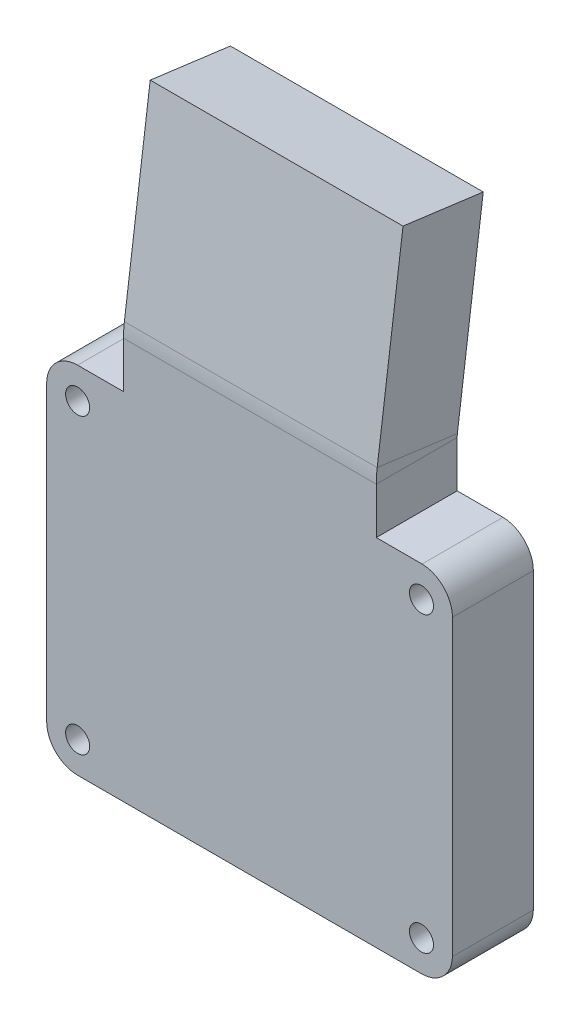
ISO-10303-21;
HEADER;
FILE_DESCRIPTION(('STEP AP214'),'2;1');
FILE_NAME('part.step','',(''),(''),'','','');
FILE_SCHEMA(('AUTOMOTIVE_DESIGN { 1 0 10303 214 1 1 1 1 }'));
ENDSEC;
DATA;
#1=APPLICATION_CONTEXT('core data for automotive mechanical design processes');
#2=APPLICATION_PROTOCOL_DEFINITION('international standard','automotive_design',2000,#1);
#3=PRODUCT_CONTEXT('',#1,'mechanical');
#4=PRODUCT('Part','Part','',(#3));
#5=PRODUCT_RELATED_PRODUCT_CATEGORY('part','',(#4));
#6=PRODUCT_DEFINITION_FORMATION('','',#4);
#7=PRODUCT_DEFINITION_CONTEXT('part definition',#1,'design');
#8=PRODUCT_DEFINITION('design','',#6,#7);
#9=PRODUCT_DEFINITION_SHAPE('','',#8);
#10=(LENGTH_UNIT() NAMED_UNIT(*) SI_UNIT(.MILLI.,.METRE.));
#11=(NAMED_UNIT(*) PLANE_ANGLE_UNIT() SI_UNIT($,.RADIAN.));
#12=(NAMED_UNIT(*) SI_UNIT($,.STERADIAN.) SOLID_ANGLE_UNIT());
#13=UNCERTAINTY_MEASURE_WITH_UNIT(LENGTH_MEASURE(1.E-05),#10,'distance_accuracy_value','');
#14=(GEOMETRIC_REPRESENTATION_CONTEXT(3) GLOBAL_UNCERTAINTY_ASSIGNED_CONTEXT((#13)) GLOBAL_UNIT_ASSIGNED_CONTEXT((#10,
#11,#12)) REPRESENTATION_CONTEXT('',''));
#15=CARTESIAN_POINT('',(0.,0.,0.));
#16=DIRECTION('',(0.,0.,1.));
#17=DIRECTION('',(1.,0.,0.));
#18=AXIS2_PLACEMENT_3D('',#15,#16,#17);
#19=CARTESIAN_POINT('',(12.5315496417796,41.8691044435004,-2.57638320426509));
#20=DIRECTION('',(-1.,0.,0.));
#21=DIRECTION('',(0.,-0.99144486137381,0.130526192220052));
#22=AXIS2_PLACEMENT_3D('',#19,#20,#21);
#23=PLANE('',#22);
#24=DIRECTION('',(0.,-0.99144486137381,0.130526192220052));
#25=VECTOR('',#24,1.);
#26=CARTESIAN_POINT('',(12.5315496417796,42.9133139812608,5.35517568672539));
#27=LINE('',#26,#25);
#28=CARTESIAN_POINT('',(12.5315496417796,42.9133139812608,5.35517568672539));
#29=VERTEX_POINT('',#28);
#30=CARTESIAN_POINT('',(12.5315496417796,23.5087967941965,7.90982883887996));
#31=VERTEX_POINT('',#30);
#32=EDGE_CURVE('E195',#29,#31,#27,.T.);
#33=ORIENTED_EDGE('',*,*,#32,.T.);
#34=DIRECTION('',(0.,-0.130526192220052,-0.99144486137381));
#35=VECTOR('',#34,1.);
#36=CARTESIAN_POINT('',(12.5315496417796,22.4645872564361,-0.0217300521105218));
#37=LINE('',#36,#35);
#38=CARTESIAN_POINT('',(12.5315496417796,22.4645872564361,-0.0217300521105218));
#39=VERTEX_POINT('',#38);
#40=EDGE_CURVE('E173',#31,#39,#37,.T.);
#41=ORIENTED_EDGE('',*,*,#40,.T.);
#42=DIRECTION('',(0.,-0.99144486137381,0.130526192220052));
#43=VECTOR('',#42,1.);
#44=CARTESIAN_POINT('',(12.5315496417796,41.8691044435004,-2.57638320426509));
#45=LINE('',#44,#43);
#46=CARTESIAN_POINT('',(12.5315496417796,41.8691044435004,-2.57638320426509));
#47=VERTEX_POINT('',#46);
#48=EDGE_CURVE('E55',#47,#39,#45,.T.);
#49=ORIENTED_EDGE('',*,*,#48,.F.);
#50=DIRECTION('',(0.,-0.130526192220052,-0.99144486137381));
#51=VECTOR('',#50,1.);
#52=CARTESIAN_POINT('',(12.5315496417796,41.8691044435004,-2.57638320426509));
#53=LINE('',#52,#51);
#54=EDGE_CURVE('E337',#29,#47,#53,.T.);
#55=ORIENTED_EDGE('',*,*,#54,.F.);
#56=EDGE_LOOP('',(#33,#41,#49,#55));
#57=FACE_BOUND('',#56,.T.);
#58=ADVANCED_FACE('F51',(#57),#23,.F.);
#59=CARTESIAN_POINT('',(-12.4684503582204,41.8691044435004,-2.57638320426509));
#60=DIRECTION('',(1.,0.,0.));
#61=DIRECTION('',(0.,0.99144486137381,-0.130526192220052));
#62=AXIS2_PLACEMENT_3D('',#59,#60,#61);
#63=PLANE('',#62);
#64=DIRECTION('',(0.,-0.99144486137381,0.130526192220052));
#65=VECTOR('',#64,1.);
#66=CARTESIAN_POINT('',(-12.4684503582204,41.8691044435004,-2.57638320426509));
#67=LINE('',#66,#65);
#68=CARTESIAN_POINT('',(-12.4684503582204,41.8691044435004,-2.57638320426509));
#69=VERTEX_POINT('',#68);
#70=CARTESIAN_POINT('',(-12.4684503582204,22.4645872564361,-0.0217300521105218));
#71=VERTEX_POINT('',#70);
#72=EDGE_CURVE('E196',#69,#71,#67,.T.);
#73=ORIENTED_EDGE('',*,*,#72,.T.);
#74=DIRECTION('',(0.,0.130526192220052,0.99144486137381));
#75=VECTOR('',#74,1.);
#76=CARTESIAN_POINT('',(-12.4684503582204,22.4645872564361,-0.0217300521105218));
#77=LINE('',#76,#75);
#78=CARTESIAN_POINT('',(-12.4684503582204,23.5087967941965,7.90982883887996));
#79=VERTEX_POINT('',#78);
#80=EDGE_CURVE('E12',#71,#79,#77,.T.);
#81=ORIENTED_EDGE('',*,*,#80,.T.);
#82=DIRECTION('',(0.,-0.99144486137381,0.130526192220052));
#83=VECTOR('',#82,1.);
#84=CARTESIAN_POINT('',(-12.4684503582204,42.9133139812608,5.35517568672539));
#85=LINE('',#84,#83);
#86=CARTESIAN_POINT('',(-12.4684503582204,42.9133139812608,5.35517568672539));
#87=VERTEX_POINT('',#86);
#88=EDGE_CURVE('E189',#87,#79,#85,.T.);
#89=ORIENTED_EDGE('',*,*,#88,.F.);
#90=DIRECTION('',(0.,0.130526192220052,0.99144486137381));
#91=VECTOR('',#90,1.);
#92=CARTESIAN_POINT('',(-12.4684503582204,41.8691044435004,-2.57638320426509));
#93=LINE('',#92,#91);
#94=EDGE_CURVE('E225',#69,#87,#93,.T.);
#95=ORIENTED_EDGE('',*,*,#94,.F.);
#96=EDGE_LOOP('',(#73,#81,#89,#95));
#97=FACE_BOUND('',#96,.T.);
#98=ADVANCED_FACE('F53',(#97),#63,.F.);
#99=CARTESIAN_POINT('',(0.,-0.327872235384642,2.97895416614723));
#100=DIRECTION('',(0.,0.130526192220052,0.99144486137381));
#101=DIRECTION('',(1.,0.,0.));
#102=AXIS2_PLACEMENT_3D('',#99,#100,#101);
#103=PLANE('',#102);
#104=ORIENTED_EDGE('',*,*,#48,.T.);
#105=DIRECTION('',(-1.,0.,0.));
#106=VECTOR('',#105,1.);
#107=CARTESIAN_POINT('',(0.,22.4645872564361,-0.0217300521105218));
#108=LINE('',#107,#106);
#109=EDGE_CURVE('E183',#39,#71,#108,.T.);
#110=ORIENTED_EDGE('',*,*,#109,.T.);
#111=ORIENTED_EDGE('',*,*,#72,.F.);
#112=DIRECTION('',(-1.,0.,0.));
#113=VECTOR('',#112,1.);
#114=CARTESIAN_POINT('',(-12.4684503582204,41.8691044435004,-2.57638320426509));
#115=LINE('',#114,#113);
#116=EDGE_CURVE('E75',#47,#69,#115,.T.);
#117=ORIENTED_EDGE('',*,*,#116,.F.);
#118=EDGE_LOOP('',(#104,#110,#111,#117));
#119=FACE_BOUND('',#118,.T.);
#120=ADVANCED_FACE('F192',(#119),#103,.F.);
#121=CARTESIAN_POINT('',(0.,0.716337302375773,10.9105130571377));
#122=DIRECTION('',(0.,0.130526192220052,0.99144486137381));
#123=DIRECTION('',(1.,0.,0.));
#124=AXIS2_PLACEMENT_3D('',#121,#122,#123);
#125=PLANE('',#124);
#126=DIRECTION('',(-1.,0.,0.));
#127=VECTOR('',#126,1.);
#128=CARTESIAN_POINT('',(0.,23.5087967941965,7.90982883887996));
#129=LINE('',#128,#127);
#130=EDGE_CURVE('E60',#31,#79,#129,.T.);
#131=ORIENTED_EDGE('',*,*,#130,.F.);
#132=ORIENTED_EDGE('',*,*,#32,.F.);
#133=DIRECTION('',(1.,0.,0.));
#134=VECTOR('',#133,1.);
#135=CARTESIAN_POINT('',(-12.4684503582204,42.9133139812608,5.35517568672539));
#136=LINE('',#135,#134);
#137=EDGE_CURVE('E208',#87,#29,#136,.T.);
#138=ORIENTED_EDGE('',*,*,#137,.F.);
#139=ORIENTED_EDGE('',*,*,#88,.T.);
#140=EDGE_LOOP('',(#131,#132,#138,#139));
#141=FACE_BOUND('',#140,.T.);
#142=ADVANCED_FACE('F207',(#141),#125,.T.);
#143=CARTESIAN_POINT('',(0.,41.8691044435004,-2.57638320426509));
#144=DIRECTION('',(0.,0.99144486137381,-0.130526192220052));
#145=DIRECTION('',(0.,0.130526192220052,0.99144486137381));
#146=AXIS2_PLACEMENT_3D('',#143,#144,#145);
#147=PLANE('',#146);
#148=ORIENTED_EDGE('',*,*,#94,.T.);
#149=ORIENTED_EDGE('',*,*,#137,.T.);
#150=ORIENTED_EDGE('',*,*,#54,.T.);
#151=ORIENTED_EDGE('',*,*,#116,.T.);
#152=EDGE_LOOP('',(#148,#149,#150,#151));
#153=FACE_BOUND('',#152,.T.);
#154=ADVANCED_FACE('F338',(#153),#147,.T.);
#155=CARTESIAN_POINT('',(16.9995430158683,14.4995430158683,8.));
#156=DIRECTION('',(0.,0.,-1.));
#157=DIRECTION('',(-1.,0.,0.));
#158=AXIS2_PLACEMENT_3D('',#155,#156,#157);
#159=CYLINDRICAL_SURFACE('',#158,1.18890727275124);
#160=CARTESIAN_POINT('',(16.9995430158683,14.4995430158683,8.));
#161=DIRECTION('',(0.,0.,1.));
#162=DIRECTION('',(1.,0.,0.));
#163=AXIS2_PLACEMENT_3D('',#160,#161,#162);
#164=CIRCLE('',#163,1.18890727275124);
#165=CARTESIAN_POINT('',(18.1884502886195,14.4995430158683,8.));
#166=VERTEX_POINT('',#165);
#167=EDGE_CURVE('E328',#166,#166,#164,.T.);
#168=ORIENTED_EDGE('',*,*,#167,.T.);
#169=EDGE_LOOP('',(#168));
#170=FACE_BOUND('',#169,.T.);
#171=CARTESIAN_POINT('',(16.9995430158683,14.4995430158683,0.));
#172=DIRECTION('',(0.,0.,1.));
#173=DIRECTION('',(1.,0.,0.));
#174=AXIS2_PLACEMENT_3D('',#171,#172,#173);
#175=CIRCLE('',#174,1.18890727275124);
#176=CARTESIAN_POINT('',(18.1884502886195,14.4995430158683,0.));
#177=VERTEX_POINT('',#176);
#178=EDGE_CURVE('E251',#177,#177,#175,.T.);
#179=ORIENTED_EDGE('',*,*,#178,.F.);
#180=EDGE_LOOP('',(#179));
#181=FACE_BOUND('',#180,.T.);
#182=ADVANCED_FACE('F340',(#170,#181),#159,.F.);
#183=CARTESIAN_POINT('',(-16.9995430158683,14.4989151594204,8.));
#184=DIRECTION('',(0.,0.,-1.));
#185=DIRECTION('',(-1.,0.,0.));
#186=AXIS2_PLACEMENT_3D('',#183,#184,#185);
#187=CYLINDRICAL_SURFACE('',#186,1.18890727275124);
#188=CARTESIAN_POINT('',(-16.9995430158683,14.4989151594204,8.));
#189=DIRECTION('',(0.,0.,1.));
#190=DIRECTION('',(1.,0.,0.));
#191=AXIS2_PLACEMENT_3D('',#188,#189,#190);
#192=CIRCLE('',#191,1.18890727275124);
#193=CARTESIAN_POINT('',(-15.8106357431171,14.4989151594204,8.));
#194=VERTEX_POINT('',#193);
#195=EDGE_CURVE('E325',#194,#194,#192,.T.);
#196=ORIENTED_EDGE('',*,*,#195,.T.);
#197=EDGE_LOOP('',(#196));
#198=FACE_BOUND('',#197,.T.);
#199=CARTESIAN_POINT('',(-16.9995430158683,14.4989151594204,0.));
#200=DIRECTION('',(0.,0.,1.));
#201=DIRECTION('',(1.,0.,0.));
#202=AXIS2_PLACEMENT_3D('',#199,#200,#201);
#203=CIRCLE('',#202,1.18890727275124);
#204=CARTESIAN_POINT('',(-15.8106357431171,14.4989151594204,0.));
#205=VERTEX_POINT('',#204);
#206=EDGE_CURVE('E254',#205,#205,#203,.T.);
#207=ORIENTED_EDGE('',*,*,#206,.F.);
#208=EDGE_LOOP('',(#207));
#209=FACE_BOUND('',#208,.T.);
#210=ADVANCED_FACE('F346',(#198,#209),#187,.F.);
#211=CARTESIAN_POINT('',(-16.9995430158681,-14.4989151594203,8.));
#212=DIRECTION('',(0.,0.,-1.));
#213=DIRECTION('',(-1.,0.,0.));
#214=AXIS2_PLACEMENT_3D('',#211,#212,#213);
#215=CYLINDRICAL_SURFACE('',#214,1.18890727275125);
#216=CARTESIAN_POINT('',(-16.9995430158681,-14.4989151594203,8.));
#217=DIRECTION('',(0.,0.,1.));
#218=DIRECTION('',(1.,0.,0.));
#219=AXIS2_PLACEMENT_3D('',#216,#217,#218);
#220=CIRCLE('',#219,1.18890727275125);
#221=CARTESIAN_POINT('',(-15.8106357431168,-14.4989151594203,8.));
#222=VERTEX_POINT('',#221);
#223=EDGE_CURVE('E322',#222,#222,#220,.T.);
#224=ORIENTED_EDGE('',*,*,#223,.T.);
#225=EDGE_LOOP('',(#224));
#226=FACE_BOUND('',#225,.T.);
#227=CARTESIAN_POINT('',(-16.9995430158681,-14.4989151594203,0.));
#228=DIRECTION('',(0.,0.,1.));
#229=DIRECTION('',(1.,0.,0.));
#230=AXIS2_PLACEMENT_3D('',#227,#228,#229);
#231=CIRCLE('',#230,1.18890727275125);
#232=CARTESIAN_POINT('',(-15.8106357431168,-14.4989151594203,0.));
#233=VERTEX_POINT('',#232);
#234=EDGE_CURVE('E257',#233,#233,#231,.T.);
#235=ORIENTED_EDGE('',*,*,#234,.F.);
#236=EDGE_LOOP('',(#235));
#237=FACE_BOUND('',#236,.T.);
#238=ADVANCED_FACE('F549',(#226,#237),#215,.F.);
#239=CARTESIAN_POINT('',(17.0001582205283,-14.4989151594205,8.));
#240=DIRECTION('',(0.,0.,-1.));
#241=DIRECTION('',(-1.,0.,0.));
#242=AXIS2_PLACEMENT_3D('',#239,#240,#241);
#243=CYLINDRICAL_SURFACE('',#242,1.18890727275123);
#244=CARTESIAN_POINT('',(17.0001582205283,-14.4989151594205,8.));
#245=DIRECTION('',(0.,0.,1.));
#246=DIRECTION('',(1.,0.,0.));
#247=AXIS2_PLACEMENT_3D('',#244,#245,#246);
#248=CIRCLE('',#247,1.18890727275123);
#249=CARTESIAN_POINT('',(18.1890654932795,-14.4989151594205,8.));
#250=VERTEX_POINT('',#249);
#251=EDGE_CURVE('E283',#250,#250,#248,.T.);
#252=ORIENTED_EDGE('',*,*,#251,.T.);
#253=EDGE_LOOP('',(#252));
#254=FACE_BOUND('',#253,.T.);
#255=CARTESIAN_POINT('',(17.0001582205283,-14.4989151594205,0.));
#256=DIRECTION('',(0.,0.,1.));
#257=DIRECTION('',(1.,0.,0.));
#258=AXIS2_PLACEMENT_3D('',#255,#256,#257);
#259=CIRCLE('',#258,1.18890727275123);
#260=CARTESIAN_POINT('',(18.1890654932795,-14.4989151594205,0.));
#261=VERTEX_POINT('',#260);
#262=EDGE_CURVE('E260',#261,#261,#259,.T.);
#263=ORIENTED_EDGE('',*,*,#262,.F.);
#264=EDGE_LOOP('',(#263));
#265=FACE_BOUND('',#264,.T.);
#266=ADVANCED_FACE('F539',(#254,#265),#243,.F.);
#267=CARTESIAN_POINT('',(0.,17.5610927272488,8.));
#268=DIRECTION('',(0.,1.,0.));
#269=DIRECTION('',(-1.,0.,0.));
#270=AXIS2_PLACEMENT_3D('',#267,#268,#269);
#271=PLANE('',#270);
#272=DIRECTION('',(1.,0.,0.));
#273=VECTOR('',#272,1.);
#274=CARTESIAN_POINT('',(0.,17.5610927272488,8.));
#275=LINE('',#274,#273);
#276=CARTESIAN_POINT('',(-16.9995430158683,17.5610927272488,8.));
#277=VERTEX_POINT('',#276);
#278=CARTESIAN_POINT('',(-12.4684503582204,17.5610927272488,8.));
#279=VERTEX_POINT('',#278);
#280=EDGE_CURVE('E279',#277,#279,#275,.T.);
#281=ORIENTED_EDGE('',*,*,#280,.T.);
#282=DIRECTION('',(0.,0.,1.));
#283=VECTOR('',#282,1.);
#284=CARTESIAN_POINT('',(-12.4684503582204,17.5610927272488,0.));
#285=LINE('',#284,#283);
#286=CARTESIAN_POINT('',(-12.4684503582204,17.5610927272488,0.));
#287=VERTEX_POINT('',#286);
#288=EDGE_CURVE('E222',#287,#279,#285,.T.);
#289=ORIENTED_EDGE('',*,*,#288,.F.);
#290=DIRECTION('',(1.,0.,0.));
#291=VECTOR('',#290,1.);
#292=CARTESIAN_POINT('',(0.,17.5610927272488,0.));
#293=LINE('',#292,#291);
#294=CARTESIAN_POINT('',(-16.9995430158683,17.5610927272488,0.));
#295=VERTEX_POINT('',#294);
#296=EDGE_CURVE('E263',#295,#287,#293,.T.);
#297=ORIENTED_EDGE('',*,*,#296,.F.);
#298=DIRECTION('',(0.,0.,-1.));
#299=VECTOR('',#298,1.);
#300=CARTESIAN_POINT('',(-16.9995430158683,17.5610927272488,8.));
#301=LINE('',#300,#299);
#302=EDGE_CURVE('E316',#277,#295,#301,.T.);
#303=ORIENTED_EDGE('',*,*,#302,.F.);
#304=EDGE_LOOP('',(#281,#289,#297,#303));
#305=FACE_BOUND('',#304,.T.);
#306=ADVANCED_FACE('F461',(#305),#271,.T.);
#307=CARTESIAN_POINT('',(-16.9995430158683,14.4989151594204,8.));
#308=DIRECTION('',(0.,0.,-1.));
#309=DIRECTION('',(-1.,0.,0.));
#310=AXIS2_PLACEMENT_3D('',#307,#308,#309);
#311=CYLINDRICAL_SURFACE('',#310,3.06217756782831);
#312=CARTESIAN_POINT('',(-16.9995430158683,14.4989151594204,0.));
#313=DIRECTION('',(0.,0.,1.));
#314=DIRECTION('',(1.,0.,0.));
#315=AXIS2_PLACEMENT_3D('',#312,#313,#314);
#316=CIRCLE('',#315,3.06217756782831);
#317=CARTESIAN_POINT('',(-20.0617205836966,14.4989151594204,0.));
#318=VERTEX_POINT('',#317);
#319=EDGE_CURVE('E282',#295,#318,#316,.T.);
#320=ORIENTED_EDGE('',*,*,#319,.T.);
#321=DIRECTION('',(0.,0.,-1.));
#322=VECTOR('',#321,1.);
#323=CARTESIAN_POINT('',(-20.0617205836966,14.4989151594204,8.));
#324=LINE('',#323,#322);
#325=CARTESIAN_POINT('',(-20.0617205836966,14.4989151594204,8.));
#326=VERTEX_POINT('',#325);
#327=EDGE_CURVE('E311',#326,#318,#324,.T.);
#328=ORIENTED_EDGE('',*,*,#327,.F.);
#329=CARTESIAN_POINT('',(-16.9995430158683,14.4989151594204,8.));
#330=DIRECTION('',(0.,0.,1.));
#331=DIRECTION('',(1.,0.,0.));
#332=AXIS2_PLACEMENT_3D('',#329,#330,#331);
#333=CIRCLE('',#332,3.06217756782831);
#334=EDGE_CURVE('E239',#277,#326,#333,.T.);
#335=ORIENTED_EDGE('',*,*,#334,.F.);
#336=ORIENTED_EDGE('',*,*,#302,.T.);
#337=EDGE_LOOP('',(#320,#328,#335,#336));
#338=FACE_BOUND('',#337,.T.);
#339=ADVANCED_FACE('F519',(#338),#311,.T.);
#340=CARTESIAN_POINT('',(-20.0617205836966,0.,8.));
#341=DIRECTION('',(-1.,0.,0.));
#342=DIRECTION('',(0.,-1.,0.));
#343=AXIS2_PLACEMENT_3D('',#340,#341,#342);
#344=PLANE('',#343);
#345=DIRECTION('',(0.,1.,0.));
#346=VECTOR('',#345,1.);
#347=CARTESIAN_POINT('',(-20.0617205836966,0.,0.));
#348=LINE('',#347,#346);
#349=CARTESIAN_POINT('',(-20.0617205836966,-14.4989151594203,0.));
#350=VERTEX_POINT('',#349);
#351=EDGE_CURVE('E266',#350,#318,#348,.T.);
#352=ORIENTED_EDGE('',*,*,#351,.F.);
#353=DIRECTION('',(0.,0.,-1.));
#354=VECTOR('',#353,1.);
#355=CARTESIAN_POINT('',(-20.0617205836966,-14.4989151594203,8.));
#356=LINE('',#355,#354);
#357=CARTESIAN_POINT('',(-20.0617205836966,-14.4989151594203,8.));
#358=VERTEX_POINT('',#357);
#359=EDGE_CURVE('E306',#358,#350,#356,.T.);
#360=ORIENTED_EDGE('',*,*,#359,.F.);
#361=DIRECTION('',(0.,1.,0.));
#362=VECTOR('',#361,1.);
#363=CARTESIAN_POINT('',(-20.0617205836966,0.,8.));
#364=LINE('',#363,#362);
#365=EDGE_CURVE('E313',#358,#326,#364,.T.);
#366=ORIENTED_EDGE('',*,*,#365,.T.);
#367=ORIENTED_EDGE('',*,*,#327,.T.);
#368=EDGE_LOOP('',(#352,#360,#366,#367));
#369=FACE_BOUND('',#368,.T.);
#370=ADVANCED_FACE('F509',(#369),#344,.T.);
#371=CARTESIAN_POINT('',(-16.9995430158681,-14.4989151594203,8.));
#372=DIRECTION('',(0.,0.,-1.));
#373=DIRECTION('',(-1.,0.,0.));
#374=AXIS2_PLACEMENT_3D('',#371,#372,#373);
#375=CYLINDRICAL_SURFACE('',#374,3.0621775678285);
#376=CARTESIAN_POINT('',(-16.9995430158681,-14.4989151594203,0.));
#377=DIRECTION('',(0.,0.,1.));
#378=DIRECTION('',(1.,0.,0.));
#379=AXIS2_PLACEMENT_3D('',#376,#377,#378);
#380=CIRCLE('',#379,3.0621775678285);
#381=CARTESIAN_POINT('',(-16.9995430158681,-17.5610927272488,0.));
#382=VERTEX_POINT('',#381);
#383=EDGE_CURVE('E308',#350,#382,#380,.T.);
#384=ORIENTED_EDGE('',*,*,#383,.T.);
#385=DIRECTION('',(0.,0.,-1.));
#386=VECTOR('',#385,1.);
#387=CARTESIAN_POINT('',(-16.9995430158681,-17.5610927272488,8.));
#388=LINE('',#387,#386);
#389=CARTESIAN_POINT('',(-16.9995430158681,-17.5610927272488,8.));
#390=VERTEX_POINT('',#389);
#391=EDGE_CURVE('E301',#390,#382,#388,.T.);
#392=ORIENTED_EDGE('',*,*,#391,.F.);
#393=CARTESIAN_POINT('',(-16.9995430158681,-14.4989151594203,8.));
#394=DIRECTION('',(0.,0.,1.));
#395=DIRECTION('',(1.,0.,0.));
#396=AXIS2_PLACEMENT_3D('',#393,#394,#395);
#397=CIRCLE('',#396,3.0621775678285);
#398=EDGE_CURVE('E237',#358,#390,#397,.T.);
#399=ORIENTED_EDGE('',*,*,#398,.F.);
#400=ORIENTED_EDGE('',*,*,#359,.T.);
#401=EDGE_LOOP('',(#384,#392,#399,#400));
#402=FACE_BOUND('',#401,.T.);
#403=ADVANCED_FACE('F499',(#402),#375,.T.);
#404=CARTESIAN_POINT('',(0.,-17.5610927272488,8.));
#405=DIRECTION('',(0.,-1.,0.));
#406=DIRECTION('',(1.,0.,0.));
#407=AXIS2_PLACEMENT_3D('',#404,#405,#406);
#408=PLANE('',#407);
#409=DIRECTION('',(-1.,0.,0.));
#410=VECTOR('',#409,1.);
#411=CARTESIAN_POINT('',(0.,-17.5610927272488,0.));
#412=LINE('',#411,#410);
#413=CARTESIAN_POINT('',(17.0001582205283,-17.5610927272488,0.));
#414=VERTEX_POINT('',#413);
#415=EDGE_CURVE('E270',#414,#382,#412,.T.);
#416=ORIENTED_EDGE('',*,*,#415,.F.);
#417=DIRECTION('',(0.,0.,-1.));
#418=VECTOR('',#417,1.);
#419=CARTESIAN_POINT('',(17.0001582205283,-17.5610927272488,8.));
#420=LINE('',#419,#418);
#421=CARTESIAN_POINT('',(17.0001582205283,-17.5610927272488,8.));
#422=VERTEX_POINT('',#421);
#423=EDGE_CURVE('E296',#422,#414,#420,.T.);
#424=ORIENTED_EDGE('',*,*,#423,.F.);
#425=DIRECTION('',(-1.,0.,0.));
#426=VECTOR('',#425,1.);
#427=CARTESIAN_POINT('',(0.,-17.5610927272488,8.));
#428=LINE('',#427,#426);
#429=EDGE_CURVE('E303',#422,#390,#428,.T.);
#430=ORIENTED_EDGE('',*,*,#429,.T.);
#431=ORIENTED_EDGE('',*,*,#391,.T.);
#432=EDGE_LOOP('',(#416,#424,#430,#431));
#433=FACE_BOUND('',#432,.T.);
#434=ADVANCED_FACE('F489',(#433),#408,.T.);
#435=CARTESIAN_POINT('',(17.0001582205283,-14.4989151594205,8.));
#436=DIRECTION('',(0.,0.,-1.));
#437=DIRECTION('',(-1.,0.,0.));
#438=AXIS2_PLACEMENT_3D('',#435,#436,#437);
#439=CYLINDRICAL_SURFACE('',#438,3.06217756782832);
#440=CARTESIAN_POINT('',(17.0001582205283,-14.4989151594205,0.));
#441=DIRECTION('',(0.,0.,1.));
#442=DIRECTION('',(1.,0.,0.));
#443=AXIS2_PLACEMENT_3D('',#440,#441,#442);
#444=CIRCLE('',#443,3.06217756782832);
#445=CARTESIAN_POINT('',(20.0617205836968,-14.5602939288841,0.));
#446=VERTEX_POINT('',#445);
#447=EDGE_CURVE('E298',#414,#446,#444,.T.);
#448=ORIENTED_EDGE('',*,*,#447,.T.);
#449=DIRECTION('',(0.,0.,-1.));
#450=VECTOR('',#449,1.);
#451=CARTESIAN_POINT('',(20.0617205836968,-14.5602939288841,8.));
#452=LINE('',#451,#450);
#453=CARTESIAN_POINT('',(20.0617205836968,-14.5602939288841,8.));
#454=VERTEX_POINT('',#453);
#455=EDGE_CURVE('E290',#454,#446,#452,.T.);
#456=ORIENTED_EDGE('',*,*,#455,.F.);
#457=CARTESIAN_POINT('',(17.0001582205283,-14.4989151594205,8.));
#458=DIRECTION('',(0.,0.,1.));
#459=DIRECTION('',(1.,0.,0.));
#460=AXIS2_PLACEMENT_3D('',#457,#458,#459);
#461=CIRCLE('',#460,3.06217756782832);
#462=EDGE_CURVE('E234',#422,#454,#461,.T.);
#463=ORIENTED_EDGE('',*,*,#462,.F.);
#464=ORIENTED_EDGE('',*,*,#423,.T.);
#465=EDGE_LOOP('',(#448,#456,#463,#464));
#466=FACE_BOUND('',#465,.T.);
#467=ADVANCED_FACE('F479',(#466),#439,.T.);
#468=CARTESIAN_POINT('',(20.0617205836968,0.,8.));
#469=DIRECTION('',(-1.,0.,0.));
#470=DIRECTION('',(0.,-1.,0.));
#471=AXIS2_PLACEMENT_3D('',#468,#469,#470);
#472=PLANE('',#471);
#473=DIRECTION('',(0.,1.,0.));
#474=VECTOR('',#473,1.);
#475=CARTESIAN_POINT('',(20.0617205836968,0.,0.));
#476=LINE('',#475,#474);
#477=CARTESIAN_POINT('',(20.0617205836968,14.4995430158683,0.));
#478=VERTEX_POINT('',#477);
#479=EDGE_CURVE('E293',#446,#478,#476,.T.);
#480=ORIENTED_EDGE('',*,*,#479,.T.);
#481=DIRECTION('',(0.,0.,-1.));
#482=VECTOR('',#481,1.);
#483=CARTESIAN_POINT('',(20.0617205836968,14.4995430158683,8.));
#484=LINE('',#483,#482);
#485=CARTESIAN_POINT('',(20.0617205836968,14.4995430158683,8.));
#486=VERTEX_POINT('',#485);
#487=EDGE_CURVE('E284',#486,#478,#484,.T.);
#488=ORIENTED_EDGE('',*,*,#487,.F.);
#489=DIRECTION('',(0.,1.,0.));
#490=VECTOR('',#489,1.);
#491=CARTESIAN_POINT('',(20.0617205836968,0.,8.));
#492=LINE('',#491,#490);
#493=EDGE_CURVE('E231',#454,#486,#492,.T.);
#494=ORIENTED_EDGE('',*,*,#493,.F.);
#495=ORIENTED_EDGE('',*,*,#455,.T.);
#496=EDGE_LOOP('',(#480,#488,#494,#495));
#497=FACE_BOUND('',#496,.T.);
#498=ADVANCED_FACE('F470',(#497),#472,.F.);
#499=CARTESIAN_POINT('',(16.9995430158683,14.4995430158683,8.));
#500=DIRECTION('',(0.,0.,-1.));
#501=DIRECTION('',(-1.,0.,0.));
#502=AXIS2_PLACEMENT_3D('',#499,#500,#501);
#503=CYLINDRICAL_SURFACE('',#502,3.0621775678284);
#504=CARTESIAN_POINT('',(16.9995430158683,14.4995430158683,0.));
#505=DIRECTION('',(0.,0.,1.));
#506=DIRECTION('',(1.,0.,0.));
#507=AXIS2_PLACEMENT_3D('',#504,#505,#506);
#508=CIRCLE('',#507,3.0621775678284);
#509=CARTESIAN_POINT('',(17.0615496417796,17.5610927272488,0.));
#510=VERTEX_POINT('',#509);
#511=EDGE_CURVE('E287',#478,#510,#508,.T.);
#512=ORIENTED_EDGE('',*,*,#511,.T.);
#513=DIRECTION('',(0.,0.,-1.));
#514=VECTOR('',#513,1.);
#515=CARTESIAN_POINT('',(17.0615496417796,17.5610927272488,8.));
#516=LINE('',#515,#514);
#517=CARTESIAN_POINT('',(17.0615496417796,17.5610927272488,8.));
#518=VERTEX_POINT('',#517);
#519=EDGE_CURVE('E275',#518,#510,#516,.T.);
#520=ORIENTED_EDGE('',*,*,#519,.F.);
#521=CARTESIAN_POINT('',(16.9995430158683,14.4995430158683,8.));
#522=DIRECTION('',(0.,0.,1.));
#523=DIRECTION('',(1.,0.,0.));
#524=AXIS2_PLACEMENT_3D('',#521,#522,#523);
#525=CIRCLE('',#524,3.0621775678284);
#526=EDGE_CURVE('E228',#486,#518,#525,.T.);
#527=ORIENTED_EDGE('',*,*,#526,.F.);
#528=ORIENTED_EDGE('',*,*,#487,.T.);
#529=EDGE_LOOP('',(#512,#520,#527,#528));
#530=FACE_BOUND('',#529,.T.);
#531=ADVANCED_FACE('F458',(#530),#503,.T.);
#532=CARTESIAN_POINT('',(12.5315496417796,17.5610927272488,0.));
#533=VERTEX_POINT('',#532);
#534=EDGE_CURVE('E267',#533,#510,#293,.T.);
#535=ORIENTED_EDGE('',*,*,#534,.F.);
#536=DIRECTION('',(0.,0.,-1.));
#537=VECTOR('',#536,1.);
#538=CARTESIAN_POINT('',(12.5315496417796,17.5610927272488,0.));
#539=LINE('',#538,#537);
#540=CARTESIAN_POINT('',(12.5315496417796,17.5610927272488,8.));
#541=VERTEX_POINT('',#540);
#542=EDGE_CURVE('E246',#541,#533,#539,.T.);
#543=ORIENTED_EDGE('',*,*,#542,.F.);
#544=EDGE_CURVE('E278',#541,#518,#275,.T.);
#545=ORIENTED_EDGE('',*,*,#544,.T.);
#546=ORIENTED_EDGE('',*,*,#519,.T.);
#547=EDGE_LOOP('',(#535,#543,#545,#546));
#548=FACE_BOUND('',#547,.T.);
#549=ADVANCED_FACE('F447',(#548),#271,.T.);
#550=CARTESIAN_POINT('',(0.,0.,0.));
#551=DIRECTION('',(0.,0.,1.));
#552=DIRECTION('',(1.,0.,0.));
#553=AXIS2_PLACEMENT_3D('',#550,#551,#552);
#554=PLANE('',#553);
#555=DIRECTION('',(-1.,0.,0.));
#556=VECTOR('',#555,1.);
#557=CARTESIAN_POINT('',(0.,22.1330507281971,0.));
#558=LINE('',#557,#556);
#559=CARTESIAN_POINT('',(12.5315496417796,22.1330507281971,0.));
#560=VERTEX_POINT('',#559);
#561=CARTESIAN_POINT('',(-12.4684503582204,22.1330507281971,0.));
#562=VERTEX_POINT('',#561);
#563=EDGE_CURVE('E333',#560,#562,#558,.T.);
#564=ORIENTED_EDGE('',*,*,#563,.F.);
#565=DIRECTION('',(0.,-1.,0.));
#566=VECTOR('',#565,1.);
#567=CARTESIAN_POINT('',(12.5315496417796,42.5610927272488,0.));
#568=LINE('',#567,#566);
#569=EDGE_CURVE('E273',#560,#533,#568,.T.);
#570=ORIENTED_EDGE('',*,*,#569,.T.);
#571=ORIENTED_EDGE('',*,*,#534,.T.);
#572=ORIENTED_EDGE('',*,*,#511,.F.);
#573=ORIENTED_EDGE('',*,*,#479,.F.);
#574=ORIENTED_EDGE('',*,*,#447,.F.);
#575=ORIENTED_EDGE('',*,*,#415,.T.);
#576=ORIENTED_EDGE('',*,*,#383,.F.);
#577=ORIENTED_EDGE('',*,*,#351,.T.);
#578=ORIENTED_EDGE('',*,*,#319,.F.);
#579=ORIENTED_EDGE('',*,*,#296,.T.);
#580=DIRECTION('',(0.,-1.,0.));
#581=VECTOR('',#580,1.);
#582=CARTESIAN_POINT('',(-12.4684503582204,42.5610927272488,0.));
#583=LINE('',#582,#581);
#584=EDGE_CURVE('E226',#562,#287,#583,.T.);
#585=ORIENTED_EDGE('',*,*,#584,.F.);
#586=EDGE_LOOP('',(#564,#570,#571,#572,#573,#574,#575,#576,#577,#578,#579,#585));
#587=FACE_BOUND('',#586,.T.);
#588=ORIENTED_EDGE('',*,*,#262,.T.);
#589=EDGE_LOOP('',(#588));
#590=FACE_BOUND('',#589,.T.);
#591=ORIENTED_EDGE('',*,*,#234,.T.);
#592=EDGE_LOOP('',(#591));
#593=FACE_BOUND('',#592,.T.);
#594=ORIENTED_EDGE('',*,*,#206,.T.);
#595=EDGE_LOOP('',(#594));
#596=FACE_BOUND('',#595,.T.);
#597=ORIENTED_EDGE('',*,*,#178,.T.);
#598=EDGE_LOOP('',(#597));
#599=FACE_BOUND('',#598,.T.);
#600=ADVANCED_FACE('F437',(#587,#590,#593,#596,#599),#554,.F.);
#601=CARTESIAN_POINT('',(12.5315496417796,42.5610927272488,0.));
#602=DIRECTION('',(-1.,0.,0.));
#603=DIRECTION('',(0.,-1.,0.));
#604=AXIS2_PLACEMENT_3D('',#601,#602,#603);
#605=PLANE('',#604);
#606=DIRECTION('',(0.,0.,-1.));
#607=VECTOR('',#606,1.);
#608=CARTESIAN_POINT('',(12.5315496417796,22.1330507281971,0.));
#609=LINE('',#608,#607);
#610=CARTESIAN_POINT('',(12.5315496417796,22.1330507281971,8.));
#611=VERTEX_POINT('',#610);
#612=EDGE_CURVE('E175',#611,#560,#609,.T.);
#613=ORIENTED_EDGE('',*,*,#612,.F.);
#614=DIRECTION('',(0.,-1.,0.));
#615=VECTOR('',#614,1.);
#616=CARTESIAN_POINT('',(12.5315496417796,42.5610927272488,8.));
#617=LINE('',#616,#615);
#618=EDGE_CURVE('E249',#611,#541,#617,.T.);
#619=ORIENTED_EDGE('',*,*,#618,.T.);
#620=ORIENTED_EDGE('',*,*,#542,.T.);
#621=ORIENTED_EDGE('',*,*,#569,.F.);
#622=EDGE_LOOP('',(#613,#619,#620,#621));
#623=FACE_BOUND('',#622,.T.);
#624=ADVANCED_FACE('F427',(#623),#605,.F.);
#625=CARTESIAN_POINT('',(0.,0.,8.));
#626=DIRECTION('',(0.,0.,1.));
#627=DIRECTION('',(1.,0.,0.));
#628=AXIS2_PLACEMENT_3D('',#625,#626,#627);
#629=PLANE('',#628);
#630=ORIENTED_EDGE('',*,*,#251,.F.);
#631=EDGE_LOOP('',(#630));
#632=FACE_BOUND('',#631,.T.);
#633=ORIENTED_EDGE('',*,*,#223,.F.);
#634=EDGE_LOOP('',(#633));
#635=FACE_BOUND('',#634,.T.);
#636=ORIENTED_EDGE('',*,*,#195,.F.);
#637=EDGE_LOOP('',(#636));
#638=FACE_BOUND('',#637,.T.);
#639=ORIENTED_EDGE('',*,*,#167,.F.);
#640=EDGE_LOOP('',(#639));
#641=FACE_BOUND('',#640,.T.);
#642=ORIENTED_EDGE('',*,*,#618,.F.);
#643=DIRECTION('',(-1.,0.,0.));
#644=VECTOR('',#643,1.);
#645=CARTESIAN_POINT('',(0.,22.1330507281971,8.));
#646=LINE('',#645,#644);
#647=CARTESIAN_POINT('',(-12.4684503582204,22.1330507281971,8.));
#648=VERTEX_POINT('',#647);
#649=EDGE_CURVE('E243',#611,#648,#646,.T.);
#650=ORIENTED_EDGE('',*,*,#649,.T.);
#651=DIRECTION('',(0.,-1.,0.));
#652=VECTOR('',#651,1.);
#653=CARTESIAN_POINT('',(-12.4684503582204,42.5610927272488,8.));
#654=LINE('',#653,#652);
#655=EDGE_CURVE('E241',#648,#279,#654,.T.);
#656=ORIENTED_EDGE('',*,*,#655,.T.);
#657=ORIENTED_EDGE('',*,*,#280,.F.);
#658=ORIENTED_EDGE('',*,*,#334,.T.);
#659=ORIENTED_EDGE('',*,*,#365,.F.);
#660=ORIENTED_EDGE('',*,*,#398,.T.);
#661=ORIENTED_EDGE('',*,*,#429,.F.);
#662=ORIENTED_EDGE('',*,*,#462,.T.);
#663=ORIENTED_EDGE('',*,*,#493,.T.);
#664=ORIENTED_EDGE('',*,*,#526,.T.);
#665=ORIENTED_EDGE('',*,*,#544,.F.);
#666=EDGE_LOOP('',(#642,#650,#656,#657,#658,#659,#660,#661,#662,#663,#664,#665));
#667=FACE_BOUND('',#666,.T.);
#668=ADVANCED_FACE('F419',(#632,#635,#638,#641,#667),#629,.T.);
#669=CARTESIAN_POINT('',(-12.4684503582204,42.5610927272488,0.));
#670=DIRECTION('',(1.,0.,0.));
#671=DIRECTION('',(0.,1.,0.));
#672=AXIS2_PLACEMENT_3D('',#669,#670,#671);
#673=PLANE('',#672);
#674=DIRECTION('',(0.,0.,1.));
#675=VECTOR('',#674,1.);
#676=CARTESIAN_POINT('',(-12.4684503582204,22.1330507281971,0.));
#677=LINE('',#676,#675);
#678=EDGE_CURVE('E215',#562,#648,#677,.T.);
#679=ORIENTED_EDGE('',*,*,#678,.F.);
#680=ORIENTED_EDGE('',*,*,#584,.T.);
#681=ORIENTED_EDGE('',*,*,#288,.T.);
#682=ORIENTED_EDGE('',*,*,#655,.F.);
#683=EDGE_LOOP('',(#679,#680,#681,#682));
#684=FACE_BOUND('',#683,.T.);
#685=ADVANCED_FACE('F378',(#684),#673,.F.);
#686=CARTESIAN_POINT('',(12.5315496417796,22.1330507281971,-2.54));
#687=DIRECTION('',(-1.,0.,0.));
#688=DIRECTION('',(0.,0.,1.));
#689=AXIS2_PLACEMENT_3D('',#686,#687,#688);
#690=PLANE('',#689);
#691=ORIENTED_EDGE('',*,*,#40,.F.);
#692=CARTESIAN_POINT('',(12.5315496417796,22.1330507281971,-2.54));
#693=DIRECTION('',(1.,0.,0.));
#694=DIRECTION('',(0.,0.,-1.));
#695=AXIS2_PLACEMENT_3D('',#692,#693,#694);
#696=CIRCLE('',#695,10.54);
#697=EDGE_CURVE('E217',#31,#611,#696,.T.);
#698=ORIENTED_EDGE('',*,*,#697,.T.);
#699=ORIENTED_EDGE('',*,*,#612,.T.);
#700=CARTESIAN_POINT('',(12.5315496417796,22.1330507281971,-2.54));
#701=DIRECTION('',(1.,0.,0.));
#702=DIRECTION('',(0.,0.,-1.));
#703=AXIS2_PLACEMENT_3D('',#700,#701,#702);
#704=CIRCLE('',#703,2.54);
#705=EDGE_CURVE('E168',#39,#560,#704,.T.);
#706=ORIENTED_EDGE('',*,*,#705,.F.);
#707=EDGE_LOOP('',(#691,#698,#699,#706));
#708=FACE_BOUND('',#707,.T.);
#709=ADVANCED_FACE('F170',(#708),#690,.F.);
#710=CARTESIAN_POINT('',(-12.4684503582204,22.1330507281971,-2.54));
#711=DIRECTION('',(1.,0.,0.));
#712=DIRECTION('',(0.,0.,-1.));
#713=AXIS2_PLACEMENT_3D('',#710,#711,#712);
#714=PLANE('',#713);
#715=ORIENTED_EDGE('',*,*,#678,.T.);
#716=CARTESIAN_POINT('',(-12.4684503582204,22.1330507281971,-2.54));
#717=DIRECTION('',(1.,0.,0.));
#718=DIRECTION('',(0.,0.,-1.));
#719=AXIS2_PLACEMENT_3D('',#716,#717,#718);
#720=CIRCLE('',#719,10.54);
#721=EDGE_CURVE('E179',#648,#79,#720,.F.);
#722=ORIENTED_EDGE('',*,*,#721,.T.);
#723=ORIENTED_EDGE('',*,*,#80,.F.);
#724=CARTESIAN_POINT('',(-12.4684503582204,22.1330507281971,-2.54));
#725=DIRECTION('',(-1.,0.,0.));
#726=DIRECTION('',(0.,0.,-1.));
#727=AXIS2_PLACEMENT_3D('',#724,#725,#726);
#728=CIRCLE('',#727,2.54);
#729=EDGE_CURVE('E178',#562,#71,#728,.T.);
#730=ORIENTED_EDGE('',*,*,#729,.F.);
#731=EDGE_LOOP('',(#715,#722,#723,#730));
#732=FACE_BOUND('',#731,.T.);
#733=ADVANCED_FACE('F213',(#732),#714,.F.);
#734=CARTESIAN_POINT('',(-26.231216393271,22.1330507281971,-2.54));
#735=DIRECTION('',(1.,0.,0.));
#736=DIRECTION('',(0.,0.,-1.));
#737=AXIS2_PLACEMENT_3D('',#734,#735,#736);
#738=CYLINDRICAL_SURFACE('',#737,2.54);
#739=ORIENTED_EDGE('',*,*,#729,.T.);
#740=ORIENTED_EDGE('',*,*,#109,.F.);
#741=ORIENTED_EDGE('',*,*,#705,.T.);
#742=ORIENTED_EDGE('',*,*,#563,.T.);
#743=EDGE_LOOP('',(#739,#740,#741,#742));
#744=FACE_BOUND('',#743,.T.);
#745=ADVANCED_FACE('F185',(#744),#738,.F.);
#746=CARTESIAN_POINT('',(-26.231216393271,22.1330507281971,-2.54));
#747=DIRECTION('',(1.,0.,0.));
#748=DIRECTION('',(0.,0.,-1.));
#749=AXIS2_PLACEMENT_3D('',#746,#747,#748);
#750=CYLINDRICAL_SURFACE('',#749,10.54);
#751=ORIENTED_EDGE('',*,*,#721,.F.);
#752=ORIENTED_EDGE('',*,*,#649,.F.);
#753=ORIENTED_EDGE('',*,*,#697,.F.);
#754=ORIENTED_EDGE('',*,*,#130,.T.);
#755=EDGE_LOOP('',(#751,#752,#753,#754));
#756=FACE_BOUND('',#755,.T.);
#757=ADVANCED_FACE('F399',(#756),#750,.T.);
#758=CLOSED_SHELL('',(#58,#98,#120,#142,#154,#182,#210,#238,#266,#306,#339,#370,#403,#434,#467,
#498,#531,#549,#600,#624,#668,#685,#709,#733,#745,#757));
#759=MANIFOLD_SOLID_BREP('B2',#758);
#760=ADVANCED_BREP_SHAPE_REPRESENTATION('',(#18,#759),#14);
#761=SHAPE_DEFINITION_REPRESENTATION(#9,#760);
ENDSEC;
END-ISO-10303-21;
